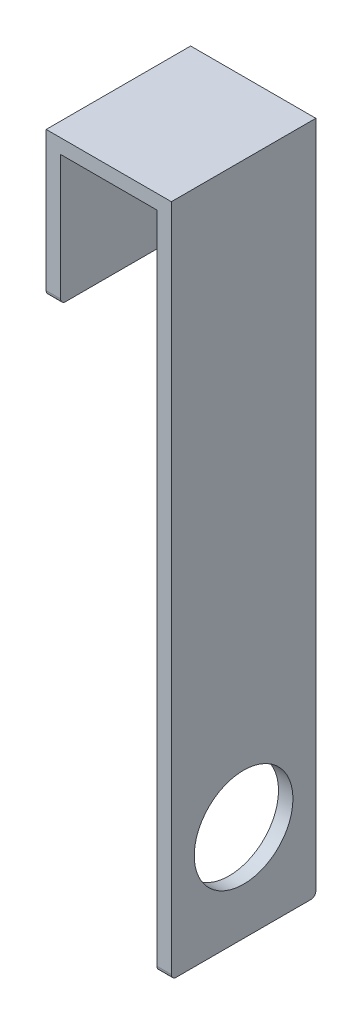
ISO-10303-21;
HEADER;
FILE_DESCRIPTION(('STEP AP214'),'2;1');
FILE_NAME('part.step','',(''),(''),'','','');
FILE_SCHEMA(('AUTOMOTIVE_DESIGN { 1 0 10303 214 1 1 1 1 }'));
ENDSEC;
DATA;
#1=APPLICATION_CONTEXT('core data for automotive mechanical design processes');
#2=APPLICATION_PROTOCOL_DEFINITION('international standard','automotive_design',2000,#1);
#3=PRODUCT_CONTEXT('',#1,'mechanical');
#4=PRODUCT('Part','Part','',(#3));
#5=PRODUCT_RELATED_PRODUCT_CATEGORY('part','',(#4));
#6=PRODUCT_DEFINITION_FORMATION('','',#4);
#7=PRODUCT_DEFINITION_CONTEXT('part definition',#1,'design');
#8=PRODUCT_DEFINITION('design','',#6,#7);
#9=PRODUCT_DEFINITION_SHAPE('','',#8);
#10=(LENGTH_UNIT() NAMED_UNIT(*) SI_UNIT(.MILLI.,.METRE.));
#11=(NAMED_UNIT(*) PLANE_ANGLE_UNIT() SI_UNIT($,.RADIAN.));
#12=(NAMED_UNIT(*) SI_UNIT($,.STERADIAN.) SOLID_ANGLE_UNIT());
#13=UNCERTAINTY_MEASURE_WITH_UNIT(LENGTH_MEASURE(1.E-05),#10,'distance_accuracy_value','');
#14=(GEOMETRIC_REPRESENTATION_CONTEXT(3) GLOBAL_UNCERTAINTY_ASSIGNED_CONTEXT((#13)) GLOBAL_UNIT_ASSIGNED_CONTEXT((#10,
#11,#12)) REPRESENTATION_CONTEXT('',''));
#15=CARTESIAN_POINT('',(0.,0.,0.));
#16=DIRECTION('',(0.,0.,1.));
#17=DIRECTION('',(1.,0.,0.));
#18=AXIS2_PLACEMENT_3D('',#15,#16,#17);
#19=CARTESIAN_POINT('',(-23.,7.02983723802944,30.));
#20=DIRECTION('',(0.,1.,0.));
#21=DIRECTION('',(-1.,0.,0.));
#22=AXIS2_PLACEMENT_3D('',#19,#20,#21);
#23=PLANE('',#22);
#24=DIRECTION('',(0.,0.,-1.));
#25=VECTOR('',#24,1.);
#26=CARTESIAN_POINT('',(-23.,7.02983723802944,30.));
#27=LINE('',#26,#25);
#28=CARTESIAN_POINT('',(-23.,7.02983723802944,29.));
#29=VERTEX_POINT('',#28);
#30=CARTESIAN_POINT('',(-23.,7.02983723802944,1.));
#31=VERTEX_POINT('',#30);
#32=EDGE_CURVE('E158',#29,#31,#27,.T.);
#33=ORIENTED_EDGE('',*,*,#32,.T.);
#34=DIRECTION('',(1.,0.,0.));
#35=VECTOR('',#34,1.);
#36=CARTESIAN_POINT('',(-23.,7.02983723802944,1.));
#37=LINE('',#36,#35);
#38=CARTESIAN_POINT('',(-20.,7.02983723802944,1.));
#39=VERTEX_POINT('',#38);
#40=EDGE_CURVE('E212',#31,#39,#37,.T.);
#41=ORIENTED_EDGE('',*,*,#40,.T.);
#42=DIRECTION('',(0.,0.,-1.));
#43=VECTOR('',#42,1.);
#44=CARTESIAN_POINT('',(-20.,7.02983723802944,30.));
#45=LINE('',#44,#43);
#46=CARTESIAN_POINT('',(-20.,7.02983723802944,29.));
#47=VERTEX_POINT('',#46);
#48=EDGE_CURVE('E141',#47,#39,#45,.T.);
#49=ORIENTED_EDGE('',*,*,#48,.F.);
#50=DIRECTION('',(1.,0.,0.));
#51=VECTOR('',#50,1.);
#52=CARTESIAN_POINT('',(-23.,7.02983723802944,29.));
#53=LINE('',#52,#51);
#54=EDGE_CURVE('E208',#47,#29,#53,.F.);
#55=ORIENTED_EDGE('',*,*,#54,.T.);
#56=EDGE_LOOP('',(#33,#41,#49,#55));
#57=FACE_BOUND('',#56,.T.);
#58=ADVANCED_FACE('F35',(#57),#23,.F.);
#59=CARTESIAN_POINT('',(-20.,7.02983723802944,30.));
#60=DIRECTION('',(-1.,0.,0.));
#61=DIRECTION('',(0.,-1.,0.));
#62=AXIS2_PLACEMENT_3D('',#59,#60,#61);
#63=PLANE('',#62);
#64=ORIENTED_EDGE('',*,*,#48,.T.);
#65=CARTESIAN_POINT('',(-20.,8.02983723802944,1.));
#66=DIRECTION('',(-1.,0.,0.));
#67=DIRECTION('',(0.,-1.,0.));
#68=AXIS2_PLACEMENT_3D('',#65,#66,#67);
#69=CIRCLE('',#68,1.);
#70=CARTESIAN_POINT('',(-20.,8.02983723802944,0.));
#71=VERTEX_POINT('',#70);
#72=EDGE_CURVE('E57',#39,#71,#69,.F.);
#73=ORIENTED_EDGE('',*,*,#72,.T.);
#74=DIRECTION('',(0.,1.,0.));
#75=VECTOR('',#74,1.);
#76=CARTESIAN_POINT('',(-20.,7.02983723802944,0.));
#77=LINE('',#76,#75);
#78=CARTESIAN_POINT('',(-20.,34.0298372380294,0.));
#79=VERTEX_POINT('',#78);
#80=EDGE_CURVE('E138',#71,#79,#77,.T.);
#81=ORIENTED_EDGE('',*,*,#80,.T.);
#82=DIRECTION('',(0.,0.,-1.));
#83=VECTOR('',#82,1.);
#84=CARTESIAN_POINT('',(-20.,34.0298372380294,30.));
#85=LINE('',#84,#83);
#86=CARTESIAN_POINT('',(-20.,34.0298372380294,30.));
#87=VERTEX_POINT('',#86);
#88=EDGE_CURVE('E136',#87,#79,#85,.T.);
#89=ORIENTED_EDGE('',*,*,#88,.F.);
#90=DIRECTION('',(0.,1.,0.));
#91=VECTOR('',#90,1.);
#92=CARTESIAN_POINT('',(-20.,7.02983723802944,30.));
#93=LINE('',#92,#91);
#94=CARTESIAN_POINT('',(-20.,8.02983723802944,30.));
#95=VERTEX_POINT('',#94);
#96=EDGE_CURVE('E123',#95,#87,#93,.T.);
#97=ORIENTED_EDGE('',*,*,#96,.F.);
#98=CARTESIAN_POINT('',(-20.,8.02983723802944,29.));
#99=DIRECTION('',(-1.,0.,0.));
#100=DIRECTION('',(0.,-1.,0.));
#101=AXIS2_PLACEMENT_3D('',#98,#99,#100);
#102=CIRCLE('',#101,1.);
#103=EDGE_CURVE('E206',#95,#47,#102,.F.);
#104=ORIENTED_EDGE('',*,*,#103,.T.);
#105=EDGE_LOOP('',(#64,#73,#81,#89,#97,#104));
#106=FACE_BOUND('',#105,.T.);
#107=ADVANCED_FACE('F137',(#106),#63,.F.);
#108=CARTESIAN_POINT('',(-20.,34.0298372380294,30.));
#109=DIRECTION('',(0.,1.,0.));
#110=DIRECTION('',(0.,0.,1.));
#111=AXIS2_PLACEMENT_3D('',#108,#109,#110);
#112=PLANE('',#111);
#113=DIRECTION('',(1.,0.,0.));
#114=VECTOR('',#113,1.);
#115=CARTESIAN_POINT('',(-20.,34.0298372380294,0.));
#116=LINE('',#115,#114);
#117=CARTESIAN_POINT('',(0.,34.0298372380294,0.));
#118=VERTEX_POINT('',#117);
#119=EDGE_CURVE('E160',#79,#118,#116,.T.);
#120=ORIENTED_EDGE('',*,*,#119,.T.);
#121=DIRECTION('',(0.,0.,-1.));
#122=VECTOR('',#121,1.);
#123=CARTESIAN_POINT('',(0.,34.0298372380294,30.));
#124=LINE('',#123,#122);
#125=CARTESIAN_POINT('',(0.,34.0298372380294,30.));
#126=VERTEX_POINT('',#125);
#127=EDGE_CURVE('E142',#126,#118,#124,.T.);
#128=ORIENTED_EDGE('',*,*,#127,.F.);
#129=DIRECTION('',(1.,0.,0.));
#130=VECTOR('',#129,1.);
#131=CARTESIAN_POINT('',(-20.,34.0298372380294,30.));
#132=LINE('',#131,#130);
#133=EDGE_CURVE('E129',#87,#126,#132,.T.);
#134=ORIENTED_EDGE('',*,*,#133,.F.);
#135=ORIENTED_EDGE('',*,*,#88,.T.);
#136=EDGE_LOOP('',(#120,#128,#134,#135));
#137=FACE_BOUND('',#136,.T.);
#138=ADVANCED_FACE('F144',(#137),#112,.F.);
#139=CARTESIAN_POINT('',(0.,34.0298372380294,30.));
#140=DIRECTION('',(1.,0.,0.));
#141=DIRECTION('',(0.,1.,0.));
#142=AXIS2_PLACEMENT_3D('',#139,#140,#141);
#143=PLANE('',#142);
#144=CARTESIAN_POINT('',(0.,-82.9701627619706,15.));
#145=DIRECTION('',(1.,0.,0.));
#146=DIRECTION('',(0.,1.,0.));
#147=AXIS2_PLACEMENT_3D('',#144,#145,#146);
#148=CIRCLE('',#147,10.25);
#149=CARTESIAN_POINT('',(0.,-72.7201627619706,15.));
#150=VERTEX_POINT('',#149);
#151=EDGE_CURVE('E161',#150,#150,#148,.T.);
#152=ORIENTED_EDGE('',*,*,#151,.T.);
#153=EDGE_LOOP('',(#152));
#154=FACE_BOUND('',#153,.T.);
#155=DIRECTION('',(0.,-1.,0.));
#156=VECTOR('',#155,1.);
#157=CARTESIAN_POINT('',(0.,34.0298372380294,0.));
#158=LINE('',#157,#156);
#159=CARTESIAN_POINT('',(0.,-101.970162761971,0.));
#160=VERTEX_POINT('',#159);
#161=EDGE_CURVE('E163',#118,#160,#158,.T.);
#162=ORIENTED_EDGE('',*,*,#161,.T.);
#163=CARTESIAN_POINT('',(0.,-101.970162761971,1.));
#164=DIRECTION('',(1.,0.,0.));
#165=DIRECTION('',(0.,1.,0.));
#166=AXIS2_PLACEMENT_3D('',#163,#164,#165);
#167=CIRCLE('',#166,1.);
#168=CARTESIAN_POINT('',(0.,-102.970162761971,1.));
#169=VERTEX_POINT('',#168);
#170=EDGE_CURVE('E203',#160,#169,#167,.F.);
#171=ORIENTED_EDGE('',*,*,#170,.T.);
#172=DIRECTION('',(0.,0.,-1.));
#173=VECTOR('',#172,1.);
#174=CARTESIAN_POINT('',(0.,-102.970162761971,30.));
#175=LINE('',#174,#173);
#176=CARTESIAN_POINT('',(0.,-102.970162761971,29.));
#177=VERTEX_POINT('',#176);
#178=EDGE_CURVE('E182',#177,#169,#175,.T.);
#179=ORIENTED_EDGE('',*,*,#178,.F.);
#180=CARTESIAN_POINT('',(0.,-101.970162761971,29.));
#181=DIRECTION('',(1.,0.,0.));
#182=DIRECTION('',(0.,1.,0.));
#183=AXIS2_PLACEMENT_3D('',#180,#181,#182);
#184=CIRCLE('',#183,1.);
#185=CARTESIAN_POINT('',(0.,-101.970162761971,30.));
#186=VERTEX_POINT('',#185);
#187=EDGE_CURVE('E194',#177,#186,#184,.F.);
#188=ORIENTED_EDGE('',*,*,#187,.T.);
#189=DIRECTION('',(0.,-1.,0.));
#190=VECTOR('',#189,1.);
#191=CARTESIAN_POINT('',(0.,34.0298372380294,30.));
#192=LINE('',#191,#190);
#193=EDGE_CURVE('E147',#126,#186,#192,.T.);
#194=ORIENTED_EDGE('',*,*,#193,.F.);
#195=ORIENTED_EDGE('',*,*,#127,.T.);
#196=EDGE_LOOP('',(#162,#171,#179,#188,#194,#195));
#197=FACE_BOUND('',#196,.T.);
#198=ADVANCED_FACE('F256',(#154,#197),#143,.F.);
#199=CARTESIAN_POINT('',(0.,-102.970162761971,30.));
#200=DIRECTION('',(0.,1.,0.));
#201=DIRECTION('',(-1.,0.,0.));
#202=AXIS2_PLACEMENT_3D('',#199,#200,#201);
#203=PLANE('',#202);
#204=ORIENTED_EDGE('',*,*,#178,.T.);
#205=DIRECTION('',(1.,0.,0.));
#206=VECTOR('',#205,1.);
#207=CARTESIAN_POINT('',(0.,-102.970162761971,1.));
#208=LINE('',#207,#206);
#209=CARTESIAN_POINT('',(3.00000000000002,-102.970162761971,1.));
#210=VERTEX_POINT('',#209);
#211=EDGE_CURVE('E196',#169,#210,#208,.T.);
#212=ORIENTED_EDGE('',*,*,#211,.T.);
#213=DIRECTION('',(0.,0.,-1.));
#214=VECTOR('',#213,1.);
#215=CARTESIAN_POINT('',(3.00000000000002,-102.970162761971,30.));
#216=LINE('',#215,#214);
#217=CARTESIAN_POINT('',(3.00000000000002,-102.970162761971,29.));
#218=VERTEX_POINT('',#217);
#219=EDGE_CURVE('E179',#218,#210,#216,.T.);
#220=ORIENTED_EDGE('',*,*,#219,.F.);
#221=DIRECTION('',(1.,0.,0.));
#222=VECTOR('',#221,1.);
#223=CARTESIAN_POINT('',(0.,-102.970162761971,29.));
#224=LINE('',#223,#222);
#225=EDGE_CURVE('E192',#218,#177,#224,.F.);
#226=ORIENTED_EDGE('',*,*,#225,.T.);
#227=EDGE_LOOP('',(#204,#212,#220,#226));
#228=FACE_BOUND('',#227,.T.);
#229=ADVANCED_FACE('F260',(#228),#203,.F.);
#230=CARTESIAN_POINT('',(3.00000000000002,-102.970162761971,30.));
#231=DIRECTION('',(-1.,0.,0.));
#232=DIRECTION('',(0.,0.,1.));
#233=AXIS2_PLACEMENT_3D('',#230,#231,#232);
#234=PLANE('',#233);
#235=CARTESIAN_POINT('',(3.00000000000002,-82.9701627619706,15.));
#236=DIRECTION('',(1.,0.,0.));
#237=DIRECTION('',(0.,0.,-1.));
#238=AXIS2_PLACEMENT_3D('',#235,#236,#237);
#239=CIRCLE('',#238,10.25);
#240=CARTESIAN_POINT('',(3.00000000000002,-82.9701627619706,4.75));
#241=VERTEX_POINT('',#240);
#242=EDGE_CURVE('E381',#241,#241,#239,.T.);
#243=ORIENTED_EDGE('',*,*,#242,.F.);
#244=EDGE_LOOP('',(#243));
#245=FACE_BOUND('',#244,.T.);
#246=ORIENTED_EDGE('',*,*,#219,.T.);
#247=CARTESIAN_POINT('',(3.00000000000002,-101.970162761971,1.));
#248=DIRECTION('',(-1.,0.,0.));
#249=DIRECTION('',(0.,0.,1.));
#250=AXIS2_PLACEMENT_3D('',#247,#248,#249);
#251=CIRCLE('',#250,1.);
#252=CARTESIAN_POINT('',(3.00000000000002,-101.970162761971,0.));
#253=VERTEX_POINT('',#252);
#254=EDGE_CURVE('E199',#210,#253,#251,.F.);
#255=ORIENTED_EDGE('',*,*,#254,.T.);
#256=DIRECTION('',(0.,1.,0.));
#257=VECTOR('',#256,1.);
#258=CARTESIAN_POINT('',(3.00000000000002,-102.970162761971,0.));
#259=LINE('',#258,#257);
#260=CARTESIAN_POINT('',(3.00000000000002,37.0298372380294,0.));
#261=VERTEX_POINT('',#260);
#262=EDGE_CURVE('E166',#253,#261,#259,.T.);
#263=ORIENTED_EDGE('',*,*,#262,.T.);
#264=DIRECTION('',(0.,0.,-1.));
#265=VECTOR('',#264,1.);
#266=CARTESIAN_POINT('',(3.00000000000002,37.0298372380294,30.));
#267=LINE('',#266,#265);
#268=CARTESIAN_POINT('',(3.00000000000002,37.0298372380294,30.));
#269=VERTEX_POINT('',#268);
#270=EDGE_CURVE('E176',#269,#261,#267,.T.);
#271=ORIENTED_EDGE('',*,*,#270,.F.);
#272=DIRECTION('',(0.,1.,0.));
#273=VECTOR('',#272,1.);
#274=CARTESIAN_POINT('',(3.00000000000002,-102.970162761971,30.));
#275=LINE('',#274,#273);
#276=CARTESIAN_POINT('',(3.00000000000002,-101.970162761971,30.));
#277=VERTEX_POINT('',#276);
#278=EDGE_CURVE('E149',#277,#269,#275,.T.);
#279=ORIENTED_EDGE('',*,*,#278,.F.);
#280=CARTESIAN_POINT('',(3.00000000000002,-101.970162761971,29.));
#281=DIRECTION('',(-1.,0.,0.));
#282=DIRECTION('',(0.,0.,1.));
#283=AXIS2_PLACEMENT_3D('',#280,#281,#282);
#284=CIRCLE('',#283,1.);
#285=EDGE_CURVE('E190',#277,#218,#284,.F.);
#286=ORIENTED_EDGE('',*,*,#285,.T.);
#287=EDGE_LOOP('',(#246,#255,#263,#271,#279,#286));
#288=FACE_BOUND('',#287,.T.);
#289=ADVANCED_FACE('F267',(#245,#288),#234,.F.);
#290=CARTESIAN_POINT('',(3.00000000000002,37.0298372380294,30.));
#291=DIRECTION('',(0.,-1.,0.));
#292=DIRECTION('',(0.,0.,-1.));
#293=AXIS2_PLACEMENT_3D('',#290,#291,#292);
#294=PLANE('',#293);
#295=DIRECTION('',(-1.,0.,0.));
#296=VECTOR('',#295,1.);
#297=CARTESIAN_POINT('',(3.00000000000002,37.0298372380294,0.));
#298=LINE('',#297,#296);
#299=CARTESIAN_POINT('',(-23.,37.0298372380294,0.));
#300=VERTEX_POINT('',#299);
#301=EDGE_CURVE('E168',#261,#300,#298,.T.);
#302=ORIENTED_EDGE('',*,*,#301,.T.);
#303=DIRECTION('',(0.,0.,-1.));
#304=VECTOR('',#303,1.);
#305=CARTESIAN_POINT('',(-23.,37.0298372380294,30.));
#306=LINE('',#305,#304);
#307=CARTESIAN_POINT('',(-23.,37.0298372380294,30.));
#308=VERTEX_POINT('',#307);
#309=EDGE_CURVE('E173',#308,#300,#306,.T.);
#310=ORIENTED_EDGE('',*,*,#309,.F.);
#311=DIRECTION('',(-1.,0.,0.));
#312=VECTOR('',#311,1.);
#313=CARTESIAN_POINT('',(3.00000000000002,37.0298372380294,30.));
#314=LINE('',#313,#312);
#315=EDGE_CURVE('E154',#269,#308,#314,.T.);
#316=ORIENTED_EDGE('',*,*,#315,.F.);
#317=ORIENTED_EDGE('',*,*,#270,.T.);
#318=EDGE_LOOP('',(#302,#310,#316,#317));
#319=FACE_BOUND('',#318,.T.);
#320=ADVANCED_FACE('F273',(#319),#294,.F.);
#321=CARTESIAN_POINT('',(-23.,37.0298372380294,30.));
#322=DIRECTION('',(1.,0.,0.));
#323=DIRECTION('',(0.,0.,-1.));
#324=AXIS2_PLACEMENT_3D('',#321,#322,#323);
#325=PLANE('',#324);
#326=DIRECTION('',(0.,-1.,0.));
#327=VECTOR('',#326,1.);
#328=CARTESIAN_POINT('',(-23.,37.0298372380294,0.));
#329=LINE('',#328,#327);
#330=CARTESIAN_POINT('',(-23.,8.02983723802944,0.));
#331=VERTEX_POINT('',#330);
#332=EDGE_CURVE('E133',#300,#331,#329,.T.);
#333=ORIENTED_EDGE('',*,*,#332,.T.);
#334=CARTESIAN_POINT('',(-23.,8.02983723802944,1.));
#335=DIRECTION('',(1.,0.,0.));
#336=DIRECTION('',(0.,0.,-1.));
#337=AXIS2_PLACEMENT_3D('',#334,#335,#336);
#338=CIRCLE('',#337,1.);
#339=EDGE_CURVE('E11',#331,#31,#338,.F.);
#340=ORIENTED_EDGE('',*,*,#339,.T.);
#341=ORIENTED_EDGE('',*,*,#32,.F.);
#342=CARTESIAN_POINT('',(-23.,8.02983723802944,29.));
#343=DIRECTION('',(1.,0.,0.));
#344=DIRECTION('',(0.,0.,-1.));
#345=AXIS2_PLACEMENT_3D('',#342,#343,#344);
#346=CIRCLE('',#345,1.);
#347=CARTESIAN_POINT('',(-23.,8.02983723802944,30.));
#348=VERTEX_POINT('',#347);
#349=EDGE_CURVE('E210',#29,#348,#346,.F.);
#350=ORIENTED_EDGE('',*,*,#349,.T.);
#351=DIRECTION('',(0.,-1.,0.));
#352=VECTOR('',#351,1.);
#353=CARTESIAN_POINT('',(-23.,37.0298372380294,30.));
#354=LINE('',#353,#352);
#355=EDGE_CURVE('E156',#308,#348,#354,.T.);
#356=ORIENTED_EDGE('',*,*,#355,.F.);
#357=ORIENTED_EDGE('',*,*,#309,.T.);
#358=EDGE_LOOP('',(#333,#340,#341,#350,#356,#357));
#359=FACE_BOUND('',#358,.T.);
#360=ADVANCED_FACE('F226',(#359),#325,.F.);
#361=CARTESIAN_POINT('',(0.,0.,30.));
#362=DIRECTION('',(0.,0.,1.));
#363=DIRECTION('',(1.,0.,0.));
#364=AXIS2_PLACEMENT_3D('',#361,#362,#363);
#365=PLANE('',#364);
#366=ORIENTED_EDGE('',*,*,#355,.T.);
#367=DIRECTION('',(1.,0.,0.));
#368=VECTOR('',#367,1.);
#369=CARTESIAN_POINT('',(-20.,8.02983723802944,30.));
#370=LINE('',#369,#368);
#371=EDGE_CURVE('E132',#348,#95,#370,.T.);
#372=ORIENTED_EDGE('',*,*,#371,.T.);
#373=ORIENTED_EDGE('',*,*,#96,.T.);
#374=ORIENTED_EDGE('',*,*,#133,.T.);
#375=ORIENTED_EDGE('',*,*,#193,.T.);
#376=DIRECTION('',(1.,0.,0.));
#377=VECTOR('',#376,1.);
#378=CARTESIAN_POINT('',(3.00000000000002,-101.970162761971,30.));
#379=LINE('',#378,#377);
#380=EDGE_CURVE('E187',#186,#277,#379,.T.);
#381=ORIENTED_EDGE('',*,*,#380,.T.);
#382=ORIENTED_EDGE('',*,*,#278,.T.);
#383=ORIENTED_EDGE('',*,*,#315,.T.);
#384=EDGE_LOOP('',(#366,#372,#373,#374,#375,#381,#382,#383));
#385=FACE_BOUND('',#384,.T.);
#386=ADVANCED_FACE('F126',(#385),#365,.T.);
#387=CARTESIAN_POINT('',(0.,0.,0.));
#388=DIRECTION('',(0.,0.,1.));
#389=DIRECTION('',(1.,0.,0.));
#390=AXIS2_PLACEMENT_3D('',#387,#388,#389);
#391=PLANE('',#390);
#392=ORIENTED_EDGE('',*,*,#80,.F.);
#393=DIRECTION('',(1.,0.,0.));
#394=VECTOR('',#393,1.);
#395=CARTESIAN_POINT('',(0.,8.02983723802945,0.));
#396=LINE('',#395,#394);
#397=EDGE_CURVE('E43',#71,#331,#396,.F.);
#398=ORIENTED_EDGE('',*,*,#397,.T.);
#399=ORIENTED_EDGE('',*,*,#332,.F.);
#400=ORIENTED_EDGE('',*,*,#301,.F.);
#401=ORIENTED_EDGE('',*,*,#262,.F.);
#402=DIRECTION('',(1.,0.,0.));
#403=VECTOR('',#402,1.);
#404=CARTESIAN_POINT('',(4.71706760512973E-13,-101.970162761971,0.));
#405=LINE('',#404,#403);
#406=EDGE_CURVE('E201',#253,#160,#405,.F.);
#407=ORIENTED_EDGE('',*,*,#406,.T.);
#408=ORIENTED_EDGE('',*,*,#161,.F.);
#409=ORIENTED_EDGE('',*,*,#119,.F.);
#410=EDGE_LOOP('',(#392,#398,#399,#400,#401,#407,#408,#409));
#411=FACE_BOUND('',#410,.T.);
#412=ADVANCED_FACE('F274',(#411),#391,.F.);
#413=CARTESIAN_POINT('',(-27.,-82.9701627619706,15.));
#414=DIRECTION('',(1.,0.,0.));
#415=DIRECTION('',(0.,0.,-1.));
#416=AXIS2_PLACEMENT_3D('',#413,#414,#415);
#417=CYLINDRICAL_SURFACE('',#416,10.25);
#418=ORIENTED_EDGE('',*,*,#242,.T.);
#419=EDGE_LOOP('',(#418));
#420=FACE_BOUND('',#419,.T.);
#421=ORIENTED_EDGE('',*,*,#151,.F.);
#422=EDGE_LOOP('',(#421));
#423=FACE_BOUND('',#422,.T.);
#424=ADVANCED_FACE('F245',(#420,#423),#417,.F.);
#425=CARTESIAN_POINT('',(4.71706760512973E-13,-101.970162761971,29.));
#426=DIRECTION('',(-1.,0.,0.));
#427=DIRECTION('',(0.,-1.,0.));
#428=AXIS2_PLACEMENT_3D('',#425,#426,#427);
#429=CYLINDRICAL_SURFACE('',#428,1.);
#430=ORIENTED_EDGE('',*,*,#187,.F.);
#431=ORIENTED_EDGE('',*,*,#225,.F.);
#432=ORIENTED_EDGE('',*,*,#285,.F.);
#433=ORIENTED_EDGE('',*,*,#380,.F.);
#434=EDGE_LOOP('',(#430,#431,#432,#433));
#435=FACE_BOUND('',#434,.T.);
#436=ADVANCED_FACE('F242',(#435),#429,.T.);
#437=CARTESIAN_POINT('',(0.,-101.970162761971,1.));
#438=DIRECTION('',(1.,0.,0.));
#439=DIRECTION('',(0.,1.,0.));
#440=AXIS2_PLACEMENT_3D('',#437,#438,#439);
#441=CYLINDRICAL_SURFACE('',#440,1.);
#442=ORIENTED_EDGE('',*,*,#170,.F.);
#443=ORIENTED_EDGE('',*,*,#406,.F.);
#444=ORIENTED_EDGE('',*,*,#254,.F.);
#445=ORIENTED_EDGE('',*,*,#211,.F.);
#446=EDGE_LOOP('',(#442,#443,#444,#445));
#447=FACE_BOUND('',#446,.T.);
#448=ADVANCED_FACE('F232',(#447),#441,.T.);
#449=CARTESIAN_POINT('',(0.,8.02983723802945,29.));
#450=DIRECTION('',(-1.,0.,0.));
#451=DIRECTION('',(0.,-1.,0.));
#452=AXIS2_PLACEMENT_3D('',#449,#450,#451);
#453=CYLINDRICAL_SURFACE('',#452,1.);
#454=ORIENTED_EDGE('',*,*,#349,.F.);
#455=ORIENTED_EDGE('',*,*,#54,.F.);
#456=ORIENTED_EDGE('',*,*,#103,.F.);
#457=ORIENTED_EDGE('',*,*,#371,.F.);
#458=EDGE_LOOP('',(#454,#455,#456,#457));
#459=FACE_BOUND('',#458,.T.);
#460=ADVANCED_FACE('F224',(#459),#453,.T.);
#461=CARTESIAN_POINT('',(-23.,8.02983723802944,1.));
#462=DIRECTION('',(1.,0.,0.));
#463=DIRECTION('',(0.,1.,0.));
#464=AXIS2_PLACEMENT_3D('',#461,#462,#463);
#465=CYLINDRICAL_SURFACE('',#464,1.);
#466=ORIENTED_EDGE('',*,*,#339,.F.);
#467=ORIENTED_EDGE('',*,*,#397,.F.);
#468=ORIENTED_EDGE('',*,*,#72,.F.);
#469=ORIENTED_EDGE('',*,*,#40,.F.);
#470=EDGE_LOOP('',(#466,#467,#468,#469));
#471=FACE_BOUND('',#470,.T.);
#472=ADVANCED_FACE('F37',(#471),#465,.T.);
#473=CLOSED_SHELL('',(#58,#107,#138,#198,#229,#289,#320,#360,#386,#412,#424,#436,#448,#460,#472));
#474=MANIFOLD_SOLID_BREP('B2',#473);
#475=ADVANCED_BREP_SHAPE_REPRESENTATION('',(#18,#474),#14);
#476=SHAPE_DEFINITION_REPRESENTATION(#9,#475);
ENDSEC;
END-ISO-10303-21;
